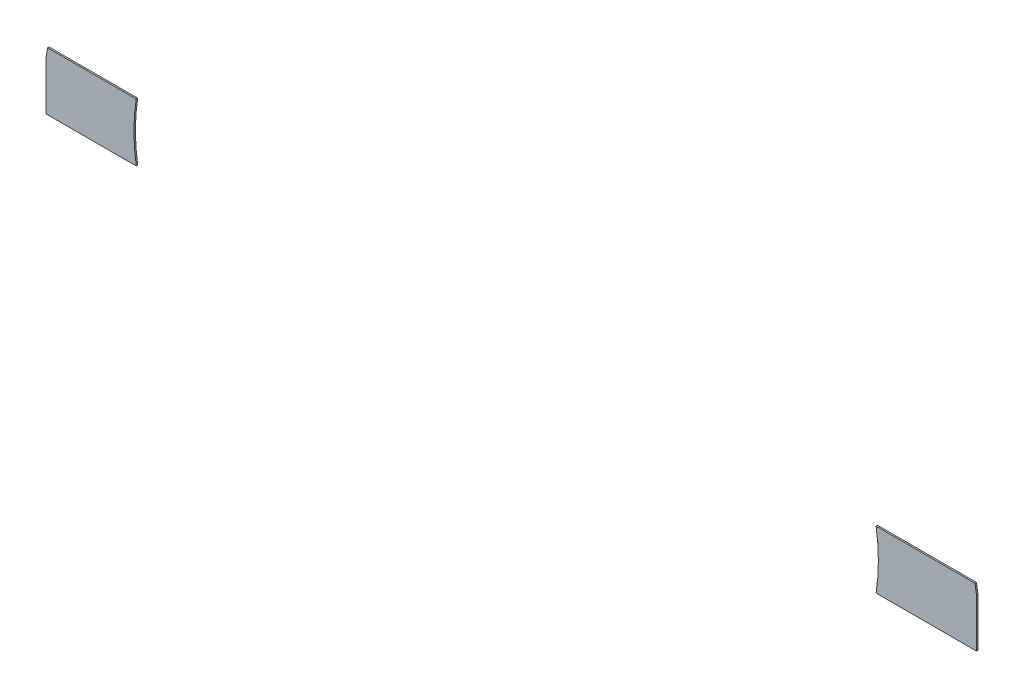
ISO-10303-21;
HEADER;
FILE_DESCRIPTION(('STEP AP214'),'2;1');
FILE_NAME('part.step','',(''),(''),'','','');
FILE_SCHEMA(('AUTOMOTIVE_DESIGN { 1 0 10303 214 1 1 1 1 }'));
ENDSEC;
DATA;
#1=APPLICATION_CONTEXT('core data for automotive mechanical design processes');
#2=APPLICATION_PROTOCOL_DEFINITION('international standard','automotive_design',2000,#1);
#3=PRODUCT_CONTEXT('',#1,'mechanical');
#4=PRODUCT('Part','Part','',(#3));
#5=PRODUCT_RELATED_PRODUCT_CATEGORY('part','',(#4));
#6=PRODUCT_DEFINITION_FORMATION('','',#4);
#7=PRODUCT_DEFINITION_CONTEXT('part definition',#1,'design');
#8=PRODUCT_DEFINITION('design','',#6,#7);
#9=PRODUCT_DEFINITION_SHAPE('','',#8);
#10=(LENGTH_UNIT() NAMED_UNIT(*) SI_UNIT(.MILLI.,.METRE.));
#11=(NAMED_UNIT(*) PLANE_ANGLE_UNIT() SI_UNIT($,.RADIAN.));
#12=(NAMED_UNIT(*) SI_UNIT($,.STERADIAN.) SOLID_ANGLE_UNIT());
#13=UNCERTAINTY_MEASURE_WITH_UNIT(LENGTH_MEASURE(1.E-05),#10,'distance_accuracy_value','');
#14=(GEOMETRIC_REPRESENTATION_CONTEXT(3) GLOBAL_UNCERTAINTY_ASSIGNED_CONTEXT((#13)) GLOBAL_UNIT_ASSIGNED_CONTEXT((#10,
#11,#12)) REPRESENTATION_CONTEXT('',''));
#15=CARTESIAN_POINT('',(0.,0.,0.));
#16=DIRECTION('',(0.,0.,1.));
#17=DIRECTION('',(1.,0.,0.));
#18=AXIS2_PLACEMENT_3D('',#15,#16,#17);
#19=CARTESIAN_POINT('',(53.1199842488873,20.2717977044879,0.1));
#20=DIRECTION('',(0.,0.,-1.));
#21=DIRECTION('',(-1.,0.,0.));
#22=AXIS2_PLACEMENT_3D('',#19,#20,#21);
#23=CYLINDRICAL_SURFACE('',#22,32.3660870183252);
#24=CARTESIAN_POINT('',(53.1199842488873,20.2717977044879,0.));
#25=DIRECTION('',(0.,0.,1.));
#26=DIRECTION('',(1.,0.,0.));
#27=AXIS2_PLACEMENT_3D('',#24,#25,#26);
#28=CIRCLE('',#27,32.3660870183252);
#29=CARTESIAN_POINT('',(21.1559896111427,25.3577229571861,0.));
#30=VERTEX_POINT('',#29);
#31=CARTESIAN_POINT('',(21.0533175822222,24.6641180214485,0.));
#32=VERTEX_POINT('',#31);
#33=EDGE_CURVE('E116',#30,#32,#28,.T.);
#34=ORIENTED_EDGE('',*,*,#33,.T.);
#35=DIRECTION('',(0.,0.,-1.));
#36=VECTOR('',#35,1.);
#37=CARTESIAN_POINT('',(21.0533175822222,24.6641180214485,0.1));
#38=LINE('',#37,#36);
#39=CARTESIAN_POINT('',(21.0533175822222,24.6641180214485,0.1));
#40=VERTEX_POINT('',#39);
#41=EDGE_CURVE('E12',#40,#32,#38,.T.);
#42=ORIENTED_EDGE('',*,*,#41,.F.);
#43=CARTESIAN_POINT('',(53.1199842488873,20.2717977044879,0.1));
#44=DIRECTION('',(0.,0.,1.));
#45=DIRECTION('',(1.,0.,0.));
#46=AXIS2_PLACEMENT_3D('',#43,#44,#45);
#47=CIRCLE('',#46,32.3660870183252);
#48=CARTESIAN_POINT('',(21.1559896111427,25.3577229571861,0.1));
#49=VERTEX_POINT('',#48);
#50=EDGE_CURVE('E124',#49,#40,#47,.T.);
#51=ORIENTED_EDGE('',*,*,#50,.F.);
#52=DIRECTION('',(0.,0.,-1.));
#53=VECTOR('',#52,1.);
#54=CARTESIAN_POINT('',(21.1559896111427,25.3577229571861,0.1));
#55=LINE('',#54,#53);
#56=EDGE_CURVE('E112',#49,#30,#55,.T.);
#57=ORIENTED_EDGE('',*,*,#56,.T.);
#58=EDGE_LOOP('',(#34,#42,#51,#57));
#59=FACE_BOUND('',#58,.T.);
#60=ADVANCED_FACE('F42',(#59),#23,.T.);
#61=CARTESIAN_POINT('',(21.0533175822222,21.3577229571861,0.1));
#62=DIRECTION('',(1.,0.,0.));
#63=DIRECTION('',(0.,1.,0.));
#64=AXIS2_PLACEMENT_3D('',#61,#62,#63);
#65=PLANE('',#64);
#66=DIRECTION('',(0.,-1.,0.));
#67=VECTOR('',#66,1.);
#68=CARTESIAN_POINT('',(21.0533175822222,21.3577229571861,0.));
#69=LINE('',#68,#67);
#70=CARTESIAN_POINT('',(21.0533175822222,21.3577229571861,0.));
#71=VERTEX_POINT('',#70);
#72=EDGE_CURVE('E119',#32,#71,#69,.T.);
#73=ORIENTED_EDGE('',*,*,#72,.T.);
#74=DIRECTION('',(0.,0.,-1.));
#75=VECTOR('',#74,1.);
#76=CARTESIAN_POINT('',(21.0533175822222,21.3577229571861,0.1));
#77=LINE('',#76,#75);
#78=CARTESIAN_POINT('',(21.0533175822222,21.3577229571861,0.1));
#79=VERTEX_POINT('',#78);
#80=EDGE_CURVE('E50',#79,#71,#77,.T.);
#81=ORIENTED_EDGE('',*,*,#80,.F.);
#82=DIRECTION('',(0.,-1.,0.));
#83=VECTOR('',#82,1.);
#84=CARTESIAN_POINT('',(21.0533175822222,21.3577229571861,0.1));
#85=LINE('',#84,#83);
#86=EDGE_CURVE('E92',#40,#79,#85,.T.);
#87=ORIENTED_EDGE('',*,*,#86,.F.);
#88=ORIENTED_EDGE('',*,*,#41,.T.);
#89=EDGE_LOOP('',(#73,#81,#87,#88));
#90=FACE_BOUND('',#89,.T.);
#91=ADVANCED_FACE('F143',(#90),#65,.F.);
#92=CARTESIAN_POINT('',(21.0533175822222,21.3577229571861,0.1));
#93=DIRECTION('',(0.,1.,0.));
#94=DIRECTION('',(0.,0.,1.));
#95=AXIS2_PLACEMENT_3D('',#92,#93,#94);
#96=PLANE('',#95);
#97=DIRECTION('',(1.,0.,0.));
#98=VECTOR('',#97,1.);
#99=CARTESIAN_POINT('',(21.0533175822222,21.3577229571861,0.));
#100=LINE('',#99,#98);
#101=CARTESIAN_POINT('',(27.2708482076803,21.3577229571861,0.));
#102=VERTEX_POINT('',#101);
#103=EDGE_CURVE('E107',#71,#102,#100,.T.);
#104=ORIENTED_EDGE('',*,*,#103,.T.);
#105=DIRECTION('',(0.,0.,-1.));
#106=VECTOR('',#105,1.);
#107=CARTESIAN_POINT('',(27.2708482076803,21.3577229571861,0.1));
#108=LINE('',#107,#106);
#109=CARTESIAN_POINT('',(27.2708482076803,21.3577229571861,0.1));
#110=VERTEX_POINT('',#109);
#111=EDGE_CURVE('E104',#110,#102,#108,.T.);
#112=ORIENTED_EDGE('',*,*,#111,.F.);
#113=DIRECTION('',(1.,0.,0.));
#114=VECTOR('',#113,1.);
#115=CARTESIAN_POINT('',(21.0533175822222,21.3577229571861,0.1));
#116=LINE('',#115,#114);
#117=EDGE_CURVE('E96',#79,#110,#116,.T.);
#118=ORIENTED_EDGE('',*,*,#117,.F.);
#119=ORIENTED_EDGE('',*,*,#80,.T.);
#120=EDGE_LOOP('',(#104,#112,#118,#119));
#121=FACE_BOUND('',#120,.T.);
#122=ADVANCED_FACE('F105',(#121),#96,.F.);
#123=CARTESIAN_POINT('',(39.9406302806987,23.3577229571861,0.1));
#124=DIRECTION('',(0.,0.,-1.));
#125=DIRECTION('',(-1.,0.,0.));
#126=AXIS2_PLACEMENT_3D('',#123,#124,#125);
#127=CYLINDRICAL_SURFACE('',#126,12.8266666666667);
#128=CARTESIAN_POINT('',(39.9406302806987,23.3577229571861,0.));
#129=DIRECTION('',(0.,0.,-1.));
#130=DIRECTION('',(1.,0.,0.));
#131=AXIS2_PLACEMENT_3D('',#128,#129,#130);
#132=CIRCLE('',#131,12.8266666666667);
#133=CARTESIAN_POINT('',(27.2708482076803,25.3577229571861,0.));
#134=VERTEX_POINT('',#133);
#135=EDGE_CURVE('E78',#102,#134,#132,.T.);
#136=ORIENTED_EDGE('',*,*,#135,.T.);
#137=DIRECTION('',(0.,0.,-1.));
#138=VECTOR('',#137,1.);
#139=CARTESIAN_POINT('',(27.2708482076803,25.3577229571861,0.1));
#140=LINE('',#139,#138);
#141=CARTESIAN_POINT('',(27.2708482076803,25.3577229571861,0.1));
#142=VERTEX_POINT('',#141);
#143=EDGE_CURVE('E108',#142,#134,#140,.T.);
#144=ORIENTED_EDGE('',*,*,#143,.F.);
#145=CARTESIAN_POINT('',(39.9406302806987,23.3577229571861,0.1));
#146=DIRECTION('',(0.,0.,-1.));
#147=DIRECTION('',(1.,0.,0.));
#148=AXIS2_PLACEMENT_3D('',#145,#146,#147);
#149=CIRCLE('',#148,12.8266666666667);
#150=EDGE_CURVE('E100',#110,#142,#149,.T.);
#151=ORIENTED_EDGE('',*,*,#150,.F.);
#152=ORIENTED_EDGE('',*,*,#111,.T.);
#153=EDGE_LOOP('',(#136,#144,#151,#152));
#154=FACE_BOUND('',#153,.T.);
#155=ADVANCED_FACE('F110',(#154),#127,.F.);
#156=CARTESIAN_POINT('',(27.2708482076803,25.3577229571861,0.1));
#157=DIRECTION('',(0.,-1.,0.));
#158=DIRECTION('',(0.,0.,-1.));
#159=AXIS2_PLACEMENT_3D('',#156,#157,#158);
#160=PLANE('',#159);
#161=DIRECTION('',(-1.,0.,0.));
#162=VECTOR('',#161,1.);
#163=CARTESIAN_POINT('',(27.2708482076803,25.3577229571861,0.));
#164=LINE('',#163,#162);
#165=EDGE_CURVE('E84',#134,#30,#164,.T.);
#166=ORIENTED_EDGE('',*,*,#165,.T.);
#167=ORIENTED_EDGE('',*,*,#56,.F.);
#168=DIRECTION('',(-1.,0.,0.));
#169=VECTOR('',#168,1.);
#170=CARTESIAN_POINT('',(27.2708482076803,25.3577229571861,0.1));
#171=LINE('',#170,#169);
#172=EDGE_CURVE('E58',#142,#49,#171,.T.);
#173=ORIENTED_EDGE('',*,*,#172,.F.);
#174=ORIENTED_EDGE('',*,*,#143,.T.);
#175=EDGE_LOOP('',(#166,#167,#173,#174));
#176=FACE_BOUND('',#175,.T.);
#177=ADVANCED_FACE('F132',(#176),#160,.F.);
#178=CARTESIAN_POINT('',(53.1199842488873,20.2717977044879,0.1));
#179=DIRECTION('',(0.,0.,1.));
#180=DIRECTION('',(1.,0.,0.));
#181=AXIS2_PLACEMENT_3D('',#178,#179,#180);
#182=PLANE('',#181);
#183=ORIENTED_EDGE('',*,*,#50,.T.);
#184=ORIENTED_EDGE('',*,*,#86,.T.);
#185=ORIENTED_EDGE('',*,*,#117,.T.);
#186=ORIENTED_EDGE('',*,*,#150,.T.);
#187=ORIENTED_EDGE('',*,*,#172,.T.);
#188=EDGE_LOOP('',(#183,#184,#185,#186,#187));
#189=FACE_BOUND('',#188,.T.);
#190=ADVANCED_FACE('F98',(#189),#182,.T.);
#191=CARTESIAN_POINT('',(53.1199842488873,20.2717977044879,0.));
#192=DIRECTION('',(0.,0.,1.));
#193=DIRECTION('',(1.,0.,0.));
#194=AXIS2_PLACEMENT_3D('',#191,#192,#193);
#195=PLANE('',#194);
#196=ORIENTED_EDGE('',*,*,#33,.F.);
#197=ORIENTED_EDGE('',*,*,#165,.F.);
#198=ORIENTED_EDGE('',*,*,#135,.F.);
#199=ORIENTED_EDGE('',*,*,#103,.F.);
#200=ORIENTED_EDGE('',*,*,#72,.F.);
#201=EDGE_LOOP('',(#196,#197,#198,#199,#200));
#202=FACE_BOUND('',#201,.T.);
#203=ADVANCED_FACE('F128',(#202),#195,.F.);
#204=CLOSED_SHELL('',(#60,#91,#122,#155,#177,#190,#203));
#205=MANIFOLD_SOLID_BREP('B2',#204);
#206=CARTESIAN_POINT('',(53.1199842488873,20.2717977044879,0.1));
#207=DIRECTION('',(0.,0.,-1.));
#208=DIRECTION('',(-1.,0.,0.));
#209=AXIS2_PLACEMENT_3D('',#206,#207,#208);
#210=CYLINDRICAL_SURFACE('',#209,32.3660870183245);
#211=CARTESIAN_POINT('',(53.1199842488873,20.2717977044879,0.));
#212=DIRECTION('',(0.,0.,1.));
#213=DIRECTION('',(1.,0.,0.));
#214=AXIS2_PLACEMENT_3D('',#211,#212,#213);
#215=CIRCLE('',#214,32.3660870183245);
#216=CARTESIAN_POINT('',(85.1866509155556,24.6641180214207,0.));
#217=VERTEX_POINT('',#216);
#218=CARTESIAN_POINT('',(85.0839788866312,25.3577229571861,0.));
#219=VERTEX_POINT('',#218);
#220=EDGE_CURVE('E265',#217,#219,#215,.T.);
#221=ORIENTED_EDGE('',*,*,#220,.T.);
#222=DIRECTION('',(0.,0.,-1.));
#223=VECTOR('',#222,1.);
#224=CARTESIAN_POINT('',(85.0839788866312,25.3577229571861,0.1));
#225=LINE('',#224,#223);
#226=CARTESIAN_POINT('',(85.0839788866312,25.3577229571861,0.1));
#227=VERTEX_POINT('',#226);
#228=EDGE_CURVE('E40',#227,#219,#225,.T.);
#229=ORIENTED_EDGE('',*,*,#228,.F.);
#230=CARTESIAN_POINT('',(53.1199842488873,20.2717977044879,0.1));
#231=DIRECTION('',(0.,0.,1.));
#232=DIRECTION('',(1.,0.,0.));
#233=AXIS2_PLACEMENT_3D('',#230,#231,#232);
#234=CIRCLE('',#233,32.3660870183245);
#235=CARTESIAN_POINT('',(85.1866509155556,24.6641180214207,0.1));
#236=VERTEX_POINT('',#235);
#237=EDGE_CURVE('E273',#236,#227,#234,.T.);
#238=ORIENTED_EDGE('',*,*,#237,.F.);
#239=DIRECTION('',(0.,0.,-1.));
#240=VECTOR('',#239,1.);
#241=CARTESIAN_POINT('',(85.1866509155556,24.6641180214207,0.1));
#242=LINE('',#241,#240);
#243=EDGE_CURVE('E261',#236,#217,#242,.T.);
#244=ORIENTED_EDGE('',*,*,#243,.T.);
#245=EDGE_LOOP('',(#221,#229,#238,#244));
#246=FACE_BOUND('',#245,.T.);
#247=ADVANCED_FACE('F191',(#246),#210,.T.);
#248=CARTESIAN_POINT('',(85.0839788866312,25.3577229571861,0.1));
#249=DIRECTION('',(0.,-1.,0.));
#250=DIRECTION('',(0.,0.,-1.));
#251=AXIS2_PLACEMENT_3D('',#248,#249,#250);
#252=PLANE('',#251);
#253=DIRECTION('',(-1.,0.,0.));
#254=VECTOR('',#253,1.);
#255=CARTESIAN_POINT('',(85.0839788866312,25.3577229571861,0.));
#256=LINE('',#255,#254);
#257=CARTESIAN_POINT('',(78.2637456870504,25.3577229571861,0.));
#258=VERTEX_POINT('',#257);
#259=EDGE_CURVE('E268',#219,#258,#256,.T.);
#260=ORIENTED_EDGE('',*,*,#259,.T.);
#261=DIRECTION('',(0.,0.,-1.));
#262=VECTOR('',#261,1.);
#263=CARTESIAN_POINT('',(78.2637456870504,25.3577229571861,0.1));
#264=LINE('',#263,#262);
#265=CARTESIAN_POINT('',(78.2637456870504,25.3577229571861,0.1));
#266=VERTEX_POINT('',#265);
#267=EDGE_CURVE('E199',#266,#258,#264,.T.);
#268=ORIENTED_EDGE('',*,*,#267,.F.);
#269=DIRECTION('',(-1.,0.,0.));
#270=VECTOR('',#269,1.);
#271=CARTESIAN_POINT('',(85.0839788866312,25.3577229571861,0.1));
#272=LINE('',#271,#270);
#273=EDGE_CURVE('E241',#227,#266,#272,.T.);
#274=ORIENTED_EDGE('',*,*,#273,.F.);
#275=ORIENTED_EDGE('',*,*,#228,.T.);
#276=EDGE_LOOP('',(#260,#268,#274,#275));
#277=FACE_BOUND('',#276,.T.);
#278=ADVANCED_FACE('F292',(#277),#252,.F.);
#279=CARTESIAN_POINT('',(65.5939636140321,23.3577229571861,0.1));
#280=DIRECTION('',(0.,0.,-1.));
#281=DIRECTION('',(-1.,0.,0.));
#282=AXIS2_PLACEMENT_3D('',#279,#280,#281);
#283=CYLINDRICAL_SURFACE('',#282,12.8266666666666);
#284=CARTESIAN_POINT('',(65.5939636140321,23.3577229571861,0.));
#285=DIRECTION('',(0.,0.,-1.));
#286=DIRECTION('',(1.,0.,0.));
#287=AXIS2_PLACEMENT_3D('',#284,#285,#286);
#288=CIRCLE('',#287,12.8266666666666);
#289=CARTESIAN_POINT('',(78.2637456870504,21.3577229571861,0.));
#290=VERTEX_POINT('',#289);
#291=EDGE_CURVE('E256',#258,#290,#288,.T.);
#292=ORIENTED_EDGE('',*,*,#291,.T.);
#293=DIRECTION('',(0.,0.,-1.));
#294=VECTOR('',#293,1.);
#295=CARTESIAN_POINT('',(78.2637456870504,21.3577229571861,0.1));
#296=LINE('',#295,#294);
#297=CARTESIAN_POINT('',(78.2637456870504,21.3577229571861,0.1));
#298=VERTEX_POINT('',#297);
#299=EDGE_CURVE('E253',#298,#290,#296,.T.);
#300=ORIENTED_EDGE('',*,*,#299,.F.);
#301=CARTESIAN_POINT('',(65.5939636140321,23.3577229571861,0.1));
#302=DIRECTION('',(0.,0.,-1.));
#303=DIRECTION('',(1.,0.,0.));
#304=AXIS2_PLACEMENT_3D('',#301,#302,#303);
#305=CIRCLE('',#304,12.8266666666666);
#306=EDGE_CURVE('E245',#266,#298,#305,.T.);
#307=ORIENTED_EDGE('',*,*,#306,.F.);
#308=ORIENTED_EDGE('',*,*,#267,.T.);
#309=EDGE_LOOP('',(#292,#300,#307,#308));
#310=FACE_BOUND('',#309,.T.);
#311=ADVANCED_FACE('F254',(#310),#283,.F.);
#312=CARTESIAN_POINT('',(78.2637456870504,21.3577229571861,0.1));
#313=DIRECTION('',(0.,1.,0.));
#314=DIRECTION('',(0.,0.,1.));
#315=AXIS2_PLACEMENT_3D('',#312,#313,#314);
#316=PLANE('',#315);
#317=DIRECTION('',(1.,0.,0.));
#318=VECTOR('',#317,1.);
#319=CARTESIAN_POINT('',(78.2637456870504,21.3577229571861,0.));
#320=LINE('',#319,#318);
#321=CARTESIAN_POINT('',(85.1866509155556,21.3577229571861,0.));
#322=VERTEX_POINT('',#321);
#323=EDGE_CURVE('E227',#290,#322,#320,.T.);
#324=ORIENTED_EDGE('',*,*,#323,.T.);
#325=DIRECTION('',(0.,0.,-1.));
#326=VECTOR('',#325,1.);
#327=CARTESIAN_POINT('',(85.1866509155556,21.3577229571861,0.1));
#328=LINE('',#327,#326);
#329=CARTESIAN_POINT('',(85.1866509155556,21.3577229571861,0.1));
#330=VERTEX_POINT('',#329);
#331=EDGE_CURVE('E257',#330,#322,#328,.T.);
#332=ORIENTED_EDGE('',*,*,#331,.F.);
#333=DIRECTION('',(1.,0.,0.));
#334=VECTOR('',#333,1.);
#335=CARTESIAN_POINT('',(78.2637456870504,21.3577229571861,0.1));
#336=LINE('',#335,#334);
#337=EDGE_CURVE('E249',#298,#330,#336,.T.);
#338=ORIENTED_EDGE('',*,*,#337,.F.);
#339=ORIENTED_EDGE('',*,*,#299,.T.);
#340=EDGE_LOOP('',(#324,#332,#338,#339));
#341=FACE_BOUND('',#340,.T.);
#342=ADVANCED_FACE('F259',(#341),#316,.F.);
#343=CARTESIAN_POINT('',(85.1866509155556,21.3577229571861,0.1));
#344=DIRECTION('',(-1.,0.,0.));
#345=DIRECTION('',(0.,0.,1.));
#346=AXIS2_PLACEMENT_3D('',#343,#344,#345);
#347=PLANE('',#346);
#348=DIRECTION('',(0.,1.,0.));
#349=VECTOR('',#348,1.);
#350=CARTESIAN_POINT('',(85.1866509155556,21.3577229571861,0.));
#351=LINE('',#350,#349);
#352=EDGE_CURVE('E233',#322,#217,#351,.T.);
#353=ORIENTED_EDGE('',*,*,#352,.T.);
#354=ORIENTED_EDGE('',*,*,#243,.F.);
#355=DIRECTION('',(0.,1.,0.));
#356=VECTOR('',#355,1.);
#357=CARTESIAN_POINT('',(85.1866509155556,21.3577229571861,0.1));
#358=LINE('',#357,#356);
#359=EDGE_CURVE('E207',#330,#236,#358,.T.);
#360=ORIENTED_EDGE('',*,*,#359,.F.);
#361=ORIENTED_EDGE('',*,*,#331,.T.);
#362=EDGE_LOOP('',(#353,#354,#360,#361));
#363=FACE_BOUND('',#362,.T.);
#364=ADVANCED_FACE('F281',(#363),#347,.F.);
#365=CARTESIAN_POINT('',(53.1199842488873,20.2717977044879,0.1));
#366=DIRECTION('',(0.,0.,1.));
#367=DIRECTION('',(1.,0.,0.));
#368=AXIS2_PLACEMENT_3D('',#365,#366,#367);
#369=PLANE('',#368);
#370=ORIENTED_EDGE('',*,*,#237,.T.);
#371=ORIENTED_EDGE('',*,*,#273,.T.);
#372=ORIENTED_EDGE('',*,*,#306,.T.);
#373=ORIENTED_EDGE('',*,*,#337,.T.);
#374=ORIENTED_EDGE('',*,*,#359,.T.);
#375=EDGE_LOOP('',(#370,#371,#372,#373,#374));
#376=FACE_BOUND('',#375,.T.);
#377=ADVANCED_FACE('F247',(#376),#369,.T.);
#378=CARTESIAN_POINT('',(53.1199842488873,20.2717977044879,0.));
#379=DIRECTION('',(0.,0.,1.));
#380=DIRECTION('',(1.,0.,0.));
#381=AXIS2_PLACEMENT_3D('',#378,#379,#380);
#382=PLANE('',#381);
#383=ORIENTED_EDGE('',*,*,#220,.F.);
#384=ORIENTED_EDGE('',*,*,#352,.F.);
#385=ORIENTED_EDGE('',*,*,#323,.F.);
#386=ORIENTED_EDGE('',*,*,#291,.F.);
#387=ORIENTED_EDGE('',*,*,#259,.F.);
#388=EDGE_LOOP('',(#383,#384,#385,#386,#387));
#389=FACE_BOUND('',#388,.T.);
#390=ADVANCED_FACE('F277',(#389),#382,.F.);
#391=CLOSED_SHELL('',(#247,#278,#311,#342,#364,#377,#390));
#392=MANIFOLD_SOLID_BREP('B6',#391);
#393=ADVANCED_BREP_SHAPE_REPRESENTATION('',(#18,#205,#392),#14);
#394=SHAPE_DEFINITION_REPRESENTATION(#9,#393);
ENDSEC;
END-ISO-10303-21;
